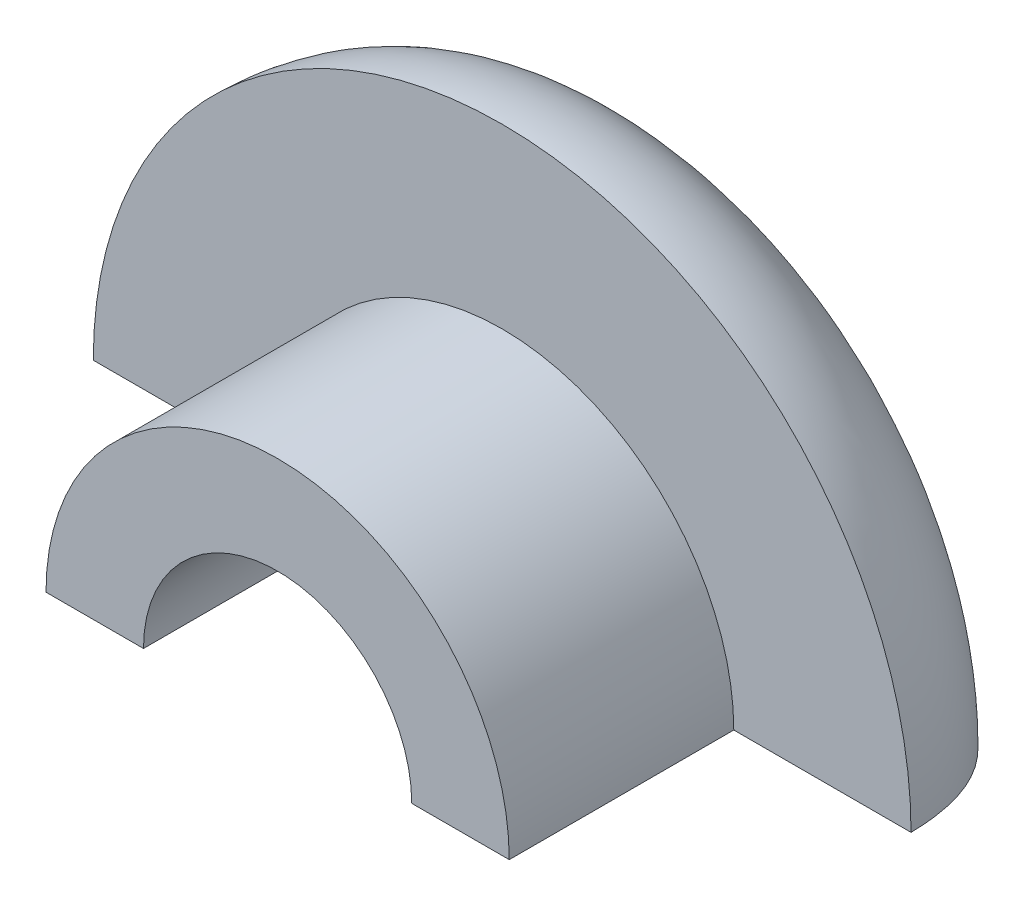
ISO-10303-21;
HEADER;
FILE_DESCRIPTION(('STEP AP214'),'2;1');
FILE_NAME('part.step','',(''),(''),'','','');
FILE_SCHEMA(('AUTOMOTIVE_DESIGN { 1 0 10303 214 1 1 1 1 }'));
ENDSEC;
DATA;
#1=APPLICATION_CONTEXT('core data for automotive mechanical design processes');
#2=APPLICATION_PROTOCOL_DEFINITION('international standard','automotive_design',2000,#1);
#3=PRODUCT_CONTEXT('',#1,'mechanical');
#4=PRODUCT('Part','Part','',(#3));
#5=PRODUCT_RELATED_PRODUCT_CATEGORY('part','',(#4));
#6=PRODUCT_DEFINITION_FORMATION('','',#4);
#7=PRODUCT_DEFINITION_CONTEXT('part definition',#1,'design');
#8=PRODUCT_DEFINITION('design','',#6,#7);
#9=PRODUCT_DEFINITION_SHAPE('','',#8);
#10=(LENGTH_UNIT() NAMED_UNIT(*) SI_UNIT(.MILLI.,.METRE.));
#11=(NAMED_UNIT(*) PLANE_ANGLE_UNIT() SI_UNIT($,.RADIAN.));
#12=(NAMED_UNIT(*) SI_UNIT($,.STERADIAN.) SOLID_ANGLE_UNIT());
#13=UNCERTAINTY_MEASURE_WITH_UNIT(LENGTH_MEASURE(1.E-05),#10,'distance_accuracy_value','');
#14=(GEOMETRIC_REPRESENTATION_CONTEXT(3) GLOBAL_UNCERTAINTY_ASSIGNED_CONTEXT((#13)) GLOBAL_UNIT_ASSIGNED_CONTEXT((#10,
#11,#12)) REPRESENTATION_CONTEXT('',''));
#15=CARTESIAN_POINT('',(0.,0.,0.));
#16=DIRECTION('',(0.,0.,1.));
#17=DIRECTION('',(1.,0.,0.));
#18=AXIS2_PLACEMENT_3D('',#15,#16,#17);
#19=CARTESIAN_POINT('',(0.,0.,4.826));
#20=DIRECTION('',(0.,0.,-1.));
#21=DIRECTION('',(-1.,0.,0.));
#22=AXIS2_PLACEMENT_3D('',#19,#20,#21);
#23=CYLINDRICAL_SURFACE('',#22,4.9784);
#24=CARTESIAN_POINT('',(0.,0.,4.826));
#25=DIRECTION('',(0.,0.,1.));
#26=DIRECTION('',(1.,0.,0.));
#27=AXIS2_PLACEMENT_3D('',#24,#25,#26);
#28=CIRCLE('',#27,4.9784);
#29=CARTESIAN_POINT('',(4.9784,0.,4.826));
#30=VERTEX_POINT('',#29);
#31=CARTESIAN_POINT('',(-4.9784,0.,4.826));
#32=VERTEX_POINT('',#31);
#33=EDGE_CURVE('E90',#30,#32,#28,.T.);
#34=ORIENTED_EDGE('',*,*,#33,.F.);
#35=DIRECTION('',(0.,0.,-1.));
#36=VECTOR('',#35,1.);
#37=CARTESIAN_POINT('',(4.9784,0.,4.826));
#38=LINE('',#37,#36);
#39=CARTESIAN_POINT('',(4.9784,0.,0.));
#40=VERTEX_POINT('',#39);
#41=EDGE_CURVE('E104',#30,#40,#38,.T.);
#42=ORIENTED_EDGE('',*,*,#41,.T.);
#43=CARTESIAN_POINT('',(0.,0.,0.));
#44=DIRECTION('',(0.,0.,-1.));
#45=DIRECTION('',(-1.,0.,0.));
#46=AXIS2_PLACEMENT_3D('',#43,#44,#45);
#47=CIRCLE('',#46,4.9784);
#48=CARTESIAN_POINT('',(-4.9784,0.,0.));
#49=VERTEX_POINT('',#48);
#50=EDGE_CURVE('E110',#49,#40,#47,.T.);
#51=ORIENTED_EDGE('',*,*,#50,.F.);
#52=DIRECTION('',(0.,0.,-1.));
#53=VECTOR('',#52,1.);
#54=CARTESIAN_POINT('',(-4.9784,0.,4.826));
#55=LINE('',#54,#53);
#56=EDGE_CURVE('E146',#49,#32,#55,.F.);
#57=ORIENTED_EDGE('',*,*,#56,.T.);
#58=EDGE_LOOP('',(#34,#42,#51,#57));
#59=FACE_BOUND('',#58,.T.);
#60=ADVANCED_FACE('F34',(#59),#23,.T.);
#61=CARTESIAN_POINT('',(0.,0.,4.826));
#62=DIRECTION('',(0.,0.,1.));
#63=DIRECTION('',(1.,0.,0.));
#64=AXIS2_PLACEMENT_3D('',#61,#62,#63);
#65=PLANE('',#64);
#66=DIRECTION('',(-1.,0.,0.));
#67=VECTOR('',#66,1.);
#68=CARTESIAN_POINT('',(0.,0.,4.826));
#69=LINE('',#68,#67);
#70=CARTESIAN_POINT('',(2.8829,0.,4.826));
#71=VERTEX_POINT('',#70);
#72=EDGE_CURVE('E138',#30,#71,#69,.T.);
#73=ORIENTED_EDGE('',*,*,#72,.F.);
#74=ORIENTED_EDGE('',*,*,#33,.T.);
#75=CARTESIAN_POINT('',(-2.8829,0.,4.826));
#76=VERTEX_POINT('',#75);
#77=EDGE_CURVE('E142',#76,#32,#69,.T.);
#78=ORIENTED_EDGE('',*,*,#77,.F.);
#79=CARTESIAN_POINT('',(0.,0.,4.826));
#80=DIRECTION('',(0.,0.,1.));
#81=DIRECTION('',(1.,0.,0.));
#82=AXIS2_PLACEMENT_3D('',#79,#80,#81);
#83=CIRCLE('',#82,2.8829);
#84=EDGE_CURVE('E97',#71,#76,#83,.T.);
#85=ORIENTED_EDGE('',*,*,#84,.F.);
#86=EDGE_LOOP('',(#73,#74,#78,#85));
#87=FACE_BOUND('',#86,.T.);
#88=ADVANCED_FACE('F128',(#87),#65,.T.);
#89=CARTESIAN_POINT('',(0.,0.,-6.35));
#90=CARTESIAN_POINT('',(0.,2.13743745063715,-6.50039288964081));
#91=CARTESIAN_POINT('',(0.,4.55722933430343,-3.19452745362301));
#92=CARTESIAN_POINT('',(0.,8.74391296615713,-2.79546434511823));
#93=CARTESIAN_POINT('',(0.,8.7884,0.));
#94=B_SPLINE_CURVE_WITH_KNOTS('',3,(#89,#90,#91,#92,#93),.UNSPECIFIED.,.F.,.F.,(4,1,4),(0.,
0.496886479095773,1.),.UNSPECIFIED.);
#95=CARTESIAN_POINT('',(0.,0.,0.));
#96=DIRECTION('',(0.,0.,1.));
#97=AXIS1_PLACEMENT('',#95,#96);
#98=SURFACE_OF_REVOLUTION('',#94,#97);
#99=CARTESIAN_POINT('',(0.,0.,-4.64299453239177));
#100=DIRECTION('',(0.,0.,1.));
#101=DIRECTION('',(1.,0.,0.));
#102=AXIS2_PLACEMENT_3D('',#99,#100,#101);
#103=CIRCLE('',#102,3.9156230986743);
#104=CARTESIAN_POINT('',(3.9156230986743,0.,-4.64299453239177));
#105=VERTEX_POINT('',#104);
#106=CARTESIAN_POINT('',(-3.9156230986743,0.,-4.64299453239177));
#107=VERTEX_POINT('',#106);
#108=EDGE_CURVE('E100',#105,#107,#103,.T.);
#109=ORIENTED_EDGE('',*,*,#108,.T.);
#110=CARTESIAN_POINT('',(0.,0.,-6.35));
#111=CARTESIAN_POINT('',(-2.13743745063715,0.,-6.50039288964081));
#112=CARTESIAN_POINT('',(-4.55722933430343,0.,-3.19452745362301));
#113=CARTESIAN_POINT('',(-8.74391296615713,0.,-2.79546434511823));
#114=CARTESIAN_POINT('',(-8.7884,0.,0.));
#115=B_SPLINE_CURVE_WITH_KNOTS('',3,(#110,#111,#112,#113,#114),.UNSPECIFIED.,.F.,.F.,(4,1,4),
(0.,0.496886479095773,1.),.UNSPECIFIED.);
#116=CARTESIAN_POINT('',(-8.7884,0.,0.));
#117=VERTEX_POINT('',#116);
#118=EDGE_CURVE('E48',#107,#117,#115,.T.);
#119=ORIENTED_EDGE('',*,*,#118,.T.);
#120=CARTESIAN_POINT('',(0.,0.,0.));
#121=DIRECTION('',(0.,0.,1.));
#122=DIRECTION('',(1.,0.,0.));
#123=AXIS2_PLACEMENT_3D('',#120,#121,#122);
#124=CIRCLE('',#123,8.7884);
#125=CARTESIAN_POINT('',(8.7884,0.,0.));
#126=VERTEX_POINT('',#125);
#127=EDGE_CURVE('E113',#126,#117,#124,.T.);
#128=ORIENTED_EDGE('',*,*,#127,.F.);
#129=CARTESIAN_POINT('',(0.,0.,-6.35));
#130=CARTESIAN_POINT('',(2.13743745063715,0.,-6.50039288964081));
#131=CARTESIAN_POINT('',(4.55722933430343,0.,-3.19452745362301));
#132=CARTESIAN_POINT('',(8.74391296615713,0.,-2.79546434511823));
#133=CARTESIAN_POINT('',(8.7884,0.,0.));
#134=B_SPLINE_CURVE_WITH_KNOTS('',3,(#129,#130,#131,#132,#133),.UNSPECIFIED.,.F.,.F.,(4,1,4),
(0.,0.496886479095773,1.),.UNSPECIFIED.);
#135=EDGE_CURVE('E140',#126,#105,#134,.F.);
#136=ORIENTED_EDGE('',*,*,#135,.T.);
#137=EDGE_LOOP('',(#109,#119,#128,#136));
#138=FACE_BOUND('',#137,.T.);
#139=ADVANCED_FACE('F124',(#138),#98,.T.);
#140=CARTESIAN_POINT('',(0.,4.9784,0.));
#141=DIRECTION('',(0.,0.,-1.));
#142=DIRECTION('',(-1.,0.,0.));
#143=AXIS2_PLACEMENT_3D('',#140,#141,#142);
#144=PLANE('',#143);
#145=ORIENTED_EDGE('',*,*,#127,.T.);
#146=DIRECTION('',(1.,0.,0.));
#147=VECTOR('',#146,1.);
#148=CARTESIAN_POINT('',(0.,0.,0.));
#149=LINE('',#148,#147);
#150=EDGE_CURVE('E106',#117,#49,#149,.T.);
#151=ORIENTED_EDGE('',*,*,#150,.T.);
#152=ORIENTED_EDGE('',*,*,#50,.T.);
#153=EDGE_CURVE('E101',#40,#126,#149,.T.);
#154=ORIENTED_EDGE('',*,*,#153,.T.);
#155=EDGE_LOOP('',(#145,#151,#152,#154));
#156=FACE_BOUND('',#155,.T.);
#157=ADVANCED_FACE('F127',(#156),#144,.F.);
#158=CARTESIAN_POINT('',(0.,0.,-6.50039288964081));
#159=DIRECTION('',(0.,0.,1.));
#160=DIRECTION('',(1.,0.,0.));
#161=AXIS2_PLACEMENT_3D('',#158,#159,#160);
#162=CYLINDRICAL_SURFACE('',#161,2.8829);
#163=ORIENTED_EDGE('',*,*,#84,.T.);
#164=DIRECTION('',(0.,0.,1.));
#165=VECTOR('',#164,1.);
#166=CARTESIAN_POINT('',(-2.8829,0.,-6.50039288964081));
#167=LINE('',#166,#165);
#168=CARTESIAN_POINT('',(-2.8829,0.,-4.64299453239177));
#169=VERTEX_POINT('',#168);
#170=EDGE_CURVE('E84',#76,#169,#167,.F.);
#171=ORIENTED_EDGE('',*,*,#170,.T.);
#172=CARTESIAN_POINT('',(0.,0.,-4.64299453239177));
#173=DIRECTION('',(0.,0.,1.));
#174=DIRECTION('',(1.,0.,0.));
#175=AXIS2_PLACEMENT_3D('',#172,#173,#174);
#176=CIRCLE('',#175,2.8829);
#177=CARTESIAN_POINT('',(2.8829,0.,-4.64299453239177));
#178=VERTEX_POINT('',#177);
#179=EDGE_CURVE('E95',#169,#178,#176,.F.);
#180=ORIENTED_EDGE('',*,*,#179,.T.);
#181=DIRECTION('',(0.,0.,1.));
#182=VECTOR('',#181,1.);
#183=CARTESIAN_POINT('',(2.8829,0.,-6.50039288964081));
#184=LINE('',#183,#182);
#185=EDGE_CURVE('E56',#178,#71,#184,.T.);
#186=ORIENTED_EDGE('',*,*,#185,.T.);
#187=EDGE_LOOP('',(#163,#171,#180,#186));
#188=FACE_BOUND('',#187,.T.);
#189=ADVANCED_FACE('F94',(#188),#162,.F.);
#190=CARTESIAN_POINT('',(0.,0.,-4.64299453239177));
#191=DIRECTION('',(0.,0.,1.));
#192=DIRECTION('',(1.,0.,0.));
#193=AXIS2_PLACEMENT_3D('',#190,#191,#192);
#194=PLANE('',#193);
#195=ORIENTED_EDGE('',*,*,#108,.F.);
#196=DIRECTION('',(-1.,0.,0.));
#197=VECTOR('',#196,1.);
#198=CARTESIAN_POINT('',(0.,0.,-4.64299453239177));
#199=LINE('',#198,#197);
#200=EDGE_CURVE('E11',#105,#178,#199,.T.);
#201=ORIENTED_EDGE('',*,*,#200,.T.);
#202=ORIENTED_EDGE('',*,*,#179,.F.);
#203=EDGE_CURVE('E37',#169,#107,#199,.T.);
#204=ORIENTED_EDGE('',*,*,#203,.T.);
#205=EDGE_LOOP('',(#195,#201,#202,#204));
#206=FACE_BOUND('',#205,.T.);
#207=ADVANCED_FACE('F99',(#206),#194,.F.);
#208=CARTESIAN_POINT('',(0.,0.,0.));
#209=DIRECTION('',(0.,1.,0.));
#210=DIRECTION('',(0.,0.,1.));
#211=AXIS2_PLACEMENT_3D('',#208,#209,#210);
#212=PLANE('',#211);
#213=ORIENTED_EDGE('',*,*,#118,.F.);
#214=ORIENTED_EDGE('',*,*,#203,.F.);
#215=ORIENTED_EDGE('',*,*,#170,.F.);
#216=ORIENTED_EDGE('',*,*,#77,.T.);
#217=ORIENTED_EDGE('',*,*,#56,.F.);
#218=ORIENTED_EDGE('',*,*,#150,.F.);
#219=EDGE_LOOP('',(#213,#214,#215,#216,#217,#218));
#220=FACE_BOUND('',#219,.T.);
#221=ADVANCED_FACE('F83',(#220),#212,.F.);
#222=ORIENTED_EDGE('',*,*,#41,.F.);
#223=ORIENTED_EDGE('',*,*,#72,.T.);
#224=ORIENTED_EDGE('',*,*,#185,.F.);
#225=ORIENTED_EDGE('',*,*,#200,.F.);
#226=ORIENTED_EDGE('',*,*,#135,.F.);
#227=ORIENTED_EDGE('',*,*,#153,.F.);
#228=EDGE_LOOP('',(#222,#223,#224,#225,#226,#227));
#229=FACE_BOUND('',#228,.T.);
#230=ADVANCED_FACE('F160',(#229),#212,.F.);
#231=CLOSED_SHELL('',(#60,#88,#139,#157,#189,#207,#221,#230));
#232=MANIFOLD_SOLID_BREP('B2',#231);
#233=ADVANCED_BREP_SHAPE_REPRESENTATION('',(#18,#232),#14);
#234=SHAPE_DEFINITION_REPRESENTATION(#9,#233);
ENDSEC;
END-ISO-10303-21;
